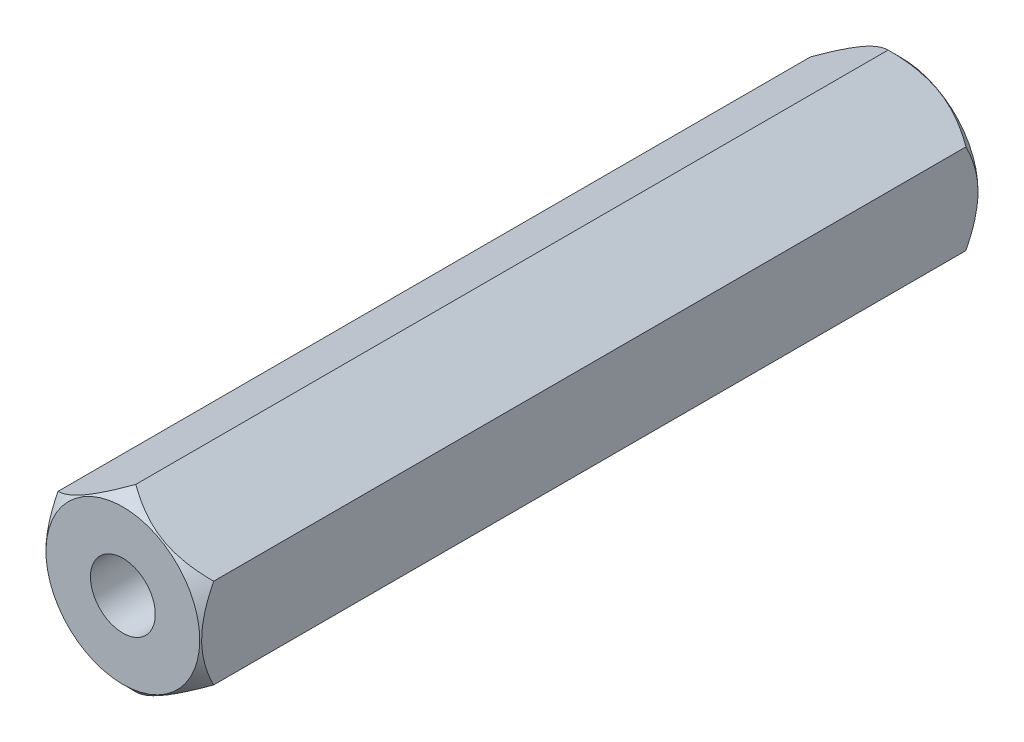
ISO-10303-21;
HEADER;
FILE_DESCRIPTION(('STEP AP214'),'2;1');
FILE_NAME('part.step','',(''),(''),'','','');
FILE_SCHEMA(('AUTOMOTIVE_DESIGN { 1 0 10303 214 1 1 1 1 }'));
ENDSEC;
DATA;
#1=APPLICATION_CONTEXT('core data for automotive mechanical design processes');
#2=APPLICATION_PROTOCOL_DEFINITION('international standard','automotive_design',2000,#1);
#3=PRODUCT_CONTEXT('',#1,'mechanical');
#4=PRODUCT('Part','Part','',(#3));
#5=PRODUCT_RELATED_PRODUCT_CATEGORY('part','',(#4));
#6=PRODUCT_DEFINITION_FORMATION('','',#4);
#7=PRODUCT_DEFINITION_CONTEXT('part definition',#1,'design');
#8=PRODUCT_DEFINITION('design','',#6,#7);
#9=PRODUCT_DEFINITION_SHAPE('','',#8);
#10=(LENGTH_UNIT() NAMED_UNIT(*) SI_UNIT(.MILLI.,.METRE.));
#11=(NAMED_UNIT(*) PLANE_ANGLE_UNIT() SI_UNIT($,.RADIAN.));
#12=(NAMED_UNIT(*) SI_UNIT($,.STERADIAN.) SOLID_ANGLE_UNIT());
#13=UNCERTAINTY_MEASURE_WITH_UNIT(LENGTH_MEASURE(1.E-05),#10,'distance_accuracy_value','');
#14=(GEOMETRIC_REPRESENTATION_CONTEXT(3) GLOBAL_UNCERTAINTY_ASSIGNED_CONTEXT((#13)) GLOBAL_UNIT_ASSIGNED_CONTEXT((#10,
#11,#12)) REPRESENTATION_CONTEXT('',''));
#15=CARTESIAN_POINT('',(0.,0.,0.));
#16=DIRECTION('',(0.,0.,1.));
#17=DIRECTION('',(1.,0.,0.));
#18=AXIS2_PLACEMENT_3D('',#15,#16,#17);
#19=CARTESIAN_POINT('',(0.,0.,30.));
#20=DIRECTION('',(0.,0.,1.));
#21=DIRECTION('',(1.,0.,0.));
#22=AXIS2_PLACEMENT_3D('',#19,#20,#21);
#23=PLANE('',#22);
#24=CARTESIAN_POINT('',(0.,0.,30.));
#25=DIRECTION('',(0.,0.,1.));
#26=DIRECTION('',(1.,0.,0.));
#27=AXIS2_PLACEMENT_3D('',#24,#25,#26);
#28=CIRCLE('',#27,2.96410161513776);
#29=CARTESIAN_POINT('',(2.96410161513776,0.,30.));
#30=VERTEX_POINT('',#29);
#31=EDGE_CURVE('E101',#30,#30,#28,.T.);
#32=ORIENTED_EDGE('',*,*,#31,.T.);
#33=EDGE_LOOP('',(#32));
#34=FACE_BOUND('',#33,.T.);
#35=CARTESIAN_POINT('',(0.,0.,30.));
#36=DIRECTION('',(0.,0.,-1.));
#37=DIRECTION('',(-1.,0.,0.));
#38=AXIS2_PLACEMENT_3D('',#35,#36,#37);
#39=CIRCLE('',#38,1.25);
#40=CARTESIAN_POINT('',(-1.25,0.,30.));
#41=VERTEX_POINT('',#40);
#42=EDGE_CURVE('E212',#41,#41,#39,.T.);
#43=ORIENTED_EDGE('',*,*,#42,.T.);
#44=EDGE_LOOP('',(#43));
#45=FACE_BOUND('',#44,.T.);
#46=ADVANCED_FACE('F35',(#34,#45),#23,.T.);
#47=CARTESIAN_POINT('',(0.,0.,0.));
#48=DIRECTION('',(0.,0.,1.));
#49=DIRECTION('',(1.,0.,0.));
#50=AXIS2_PLACEMENT_3D('',#47,#48,#49);
#51=PLANE('',#50);
#52=CARTESIAN_POINT('',(0.,0.,0.));
#53=DIRECTION('',(0.,0.,1.));
#54=DIRECTION('',(1.,0.,0.));
#55=AXIS2_PLACEMENT_3D('',#52,#53,#54);
#56=CIRCLE('',#55,2.96410161513776);
#57=CARTESIAN_POINT('',(2.96410161513776,0.,0.));
#58=VERTEX_POINT('',#57);
#59=EDGE_CURVE('E210',#58,#58,#56,.T.);
#60=ORIENTED_EDGE('',*,*,#59,.F.);
#61=EDGE_LOOP('',(#60));
#62=FACE_BOUND('',#61,.T.);
#63=CARTESIAN_POINT('',(0.,0.,0.));
#64=DIRECTION('',(0.,0.,-1.));
#65=DIRECTION('',(-1.,0.,0.));
#66=AXIS2_PLACEMENT_3D('',#63,#64,#65);
#67=CIRCLE('',#66,1.24999999999999);
#68=CARTESIAN_POINT('',(-1.24999999999999,0.,0.));
#69=VERTEX_POINT('',#68);
#70=EDGE_CURVE('E232',#69,#69,#67,.T.);
#71=ORIENTED_EDGE('',*,*,#70,.F.);
#72=EDGE_LOOP('',(#71));
#73=FACE_BOUND('',#72,.T.);
#74=ADVANCED_FACE('F220',(#62,#73),#51,.F.);
#75=CARTESIAN_POINT('',(2.99999999999996,1.73205080756891,30.));
#76=DIRECTION('',(-0.499999999999998,-0.866025403784439,0.));
#77=DIRECTION('',(0.86602540378444,-0.499999999999999,0.));
#78=AXIS2_PLACEMENT_3D('',#75,#76,#77);
#79=PLANE('',#78);
#80=CARTESIAN_POINT('',(-0.000200000000005701,3.4642170851916,0.500115475827093));
#81=CARTESIAN_POINT('',(0.102923514955752,3.40467869607211,0.440628318321731));
#82=CARTESIAN_POINT('',(0.207771389330664,3.34414474757779,0.384634979465466));
#83=CARTESIAN_POINT('',(0.42156767178113,3.22070940635328,0.282112596378893));
#84=CARTESIAN_POINT('',(0.530536411379804,3.15779627521273,0.235640593741245));
#85=CARTESIAN_POINT('',(0.750266639597091,3.03093496880238,0.156033188516258));
#86=CARTESIAN_POINT('',(0.860972171762284,2.96701910000603,0.122697700642632));
#87=CARTESIAN_POINT('',(1.08482041056542,2.83778025907541,0.0713375439792789));
#88=CARTESIAN_POINT('',(1.19795627920709,2.77246123486014,0.0532745375355815));
#89=CARTESIAN_POINT('',(1.39294095619282,2.65988677911458,0.0369769084504857));
#90=CARTESIAN_POINT('',(1.47453795400227,2.61277673046423,0.0345643671738004));
#91=CARTESIAN_POINT('',(1.63759922883024,2.51863325954789,0.0386294346571176));
#92=CARTESIAN_POINT('',(1.71906344929915,2.47159986993085,0.0451101600283165));
#93=CARTESIAN_POINT('',(1.88122011233856,2.37797867687415,0.0665917225152473));
#94=CARTESIAN_POINT('',(1.9619115887845,2.33139143122678,0.0816020899673097));
#95=CARTESIAN_POINT('',(2.12190869789156,2.23901705721426,0.119323646066059));
#96=CARTESIAN_POINT('',(2.20121443630953,2.19322986779036,0.142034244322884));
#97=CARTESIAN_POINT('',(2.34200614080297,2.11194373930141,0.188760684853999));
#98=CARTESIAN_POINT('',(2.40380372214622,2.07626488907762,0.211548327680848));
#99=CARTESIAN_POINT('',(2.52628941752036,2.00554773988148,0.260796286057478));
#100=CARTESIAN_POINT('',(2.58697749763572,1.97050946049027,0.287256713666218));
#101=CARTESIAN_POINT('',(2.70705299739094,1.90118383838352,0.343256994391358));
#102=CARTESIAN_POINT('',(2.76644383229597,1.8668945238637,0.372787164478353));
#103=CARTESIAN_POINT('',(2.88412556146727,1.79895094584795,0.434539091575483));
#104=CARTESIAN_POINT('',(2.94241710424772,1.76529630793218,0.466759196659295));
#105=CARTESIAN_POINT('',(3.00019999999996,1.73193533751507,0.500115475827071));
#106=B_SPLINE_CURVE_WITH_KNOTS('',3,(#80,#81,#82,#83,#84,#85,#86,#87,#88,#89,#90,#91,#92,#93,
#94,#95,#96,#97,#98,#99,#100,#101,#102,#103,#104,#105),.UNSPECIFIED.,.F.,.F.,(4,2,2,2,2,2,2,2,2,
2,2,2,4),(0.,0.399603557139335,0.801535286397903,1.19708369162351,1.59163620080184,
1.8739894175586,2.15644160919112,2.43921001247448,2.72195674032165,2.94657516661945,
3.17120044767284,3.39513752837811,3.61893808380731),.UNSPECIFIED.);
#107=CARTESIAN_POINT('',(0.,3.46410161513776,0.499999999999945));
#108=VERTEX_POINT('',#107);
#109=CARTESIAN_POINT('',(2.99999999999996,1.73205080756891,0.5));
#110=VERTEX_POINT('',#109);
#111=EDGE_CURVE('E51',#108,#110,#106,.T.);
#112=ORIENTED_EDGE('',*,*,#111,.F.);
#113=DIRECTION('',(0.,0.,-1.));
#114=VECTOR('',#113,1.);
#115=CARTESIAN_POINT('',(0.,3.46410161513776,30.));
#116=LINE('',#115,#114);
#117=CARTESIAN_POINT('',(0.,3.46410161513776,29.5));
#118=VERTEX_POINT('',#117);
#119=EDGE_CURVE('E11',#118,#108,#116,.T.);
#120=ORIENTED_EDGE('',*,*,#119,.F.);
#121=CARTESIAN_POINT('',(3.00019999999996,1.73193533751507,29.4998845241728));
#122=CARTESIAN_POINT('',(2.89707648504422,1.79147372663454,29.5593716816782));
#123=CARTESIAN_POINT('',(2.79222861066933,1.85200767512885,29.6153650205345));
#124=CARTESIAN_POINT('',(2.57843232821891,1.97544301635334,29.717887403621));
#125=CARTESIAN_POINT('',(2.46946358862026,2.03835614749387,29.7643594062587));
#126=CARTESIAN_POINT('',(2.24973336040302,2.1652174539042,29.8439668114837));
#127=CARTESIAN_POINT('',(2.13902782823785,2.22913332270054,29.8773022993573));
#128=CARTESIAN_POINT('',(1.91517958943476,2.35837216363113,29.9286624560207));
#129=CARTESIAN_POINT('',(1.8020437207931,2.42369118784639,29.9467254624644));
#130=CARTESIAN_POINT('',(1.60705904380741,2.53626564359193,29.9630230915495));
#131=CARTESIAN_POINT('',(1.52546204599799,2.58337569224226,29.9654356328262));
#132=CARTESIAN_POINT('',(1.36240077117006,2.67751916315857,29.9613705653429));
#133=CARTESIAN_POINT('',(1.28093655070118,2.7245525527756,29.9548898399717));
#134=CARTESIAN_POINT('',(1.11877988766182,2.81817374583227,29.9334082774848));
#135=CARTESIAN_POINT('',(1.0380884112159,2.86476099147963,29.9183979100328));
#136=CARTESIAN_POINT('',(0.878091302108885,2.95713536549212,29.8806763539341));
#137=CARTESIAN_POINT('',(0.798785563690934,3.00292255491601,29.8579657556772));
#138=CARTESIAN_POINT('',(0.657993859197466,3.08420868340498,29.8112393151461));
#139=CARTESIAN_POINT('',(0.596196277854172,3.1198875336288,29.7884516723193));
#140=CARTESIAN_POINT('',(0.473710582479935,3.19060468282499,29.7392037139426));
#141=CARTESIAN_POINT('',(0.41302250236453,3.22564296221622,29.7127432863339));
#142=CARTESIAN_POINT('',(0.292947002609228,3.29496858432302,29.6567430056087));
#143=CARTESIAN_POINT('',(0.233556167704153,3.32925789884286,29.6272128355217));
#144=CARTESIAN_POINT('',(0.115874438532763,3.39720147685867,29.5654609084245));
#145=CARTESIAN_POINT('',(0.0575828957522782,3.43085611477446,29.5332408033406));
#146=CARTESIAN_POINT('',(-0.000200000000005748,3.4642170851916,29.4998845241728));
#147=B_SPLINE_CURVE_WITH_KNOTS('',3,(#121,#122,#123,#124,#125,#126,#127,#128,#129,#130,#131,
#132,#133,#134,#135,#136,#137,#138,#139,#140,#141,#142,#143,#144,#145,#146),.UNSPECIFIED.,.F.,
.F.,(4,2,2,2,2,2,2,2,2,2,2,2,4),(0.,0.399603557139266,0.801535286397766,1.19708369162331,
1.59163620080157,1.87398941755825,2.15644160919069,2.43921001247397,2.72195674032106,
2.94657516661902,3.17120044767258,3.39513752837801,3.61893808380738),.UNSPECIFIED.);
#148=CARTESIAN_POINT('',(2.99999999999996,1.73205080756895,29.5));
#149=VERTEX_POINT('',#148);
#150=EDGE_CURVE('E107',#149,#118,#147,.T.);
#151=ORIENTED_EDGE('',*,*,#150,.F.);
#152=DIRECTION('',(0.,0.,-1.));
#153=VECTOR('',#152,1.);
#154=CARTESIAN_POINT('',(2.99999999999996,1.73205080756891,30.));
#155=LINE('',#154,#153);
#156=EDGE_CURVE('E100',#149,#110,#155,.T.);
#157=ORIENTED_EDGE('',*,*,#156,.T.);
#158=EDGE_LOOP('',(#112,#120,#151,#157));
#159=FACE_BOUND('',#158,.T.);
#160=ADVANCED_FACE('F37',(#159),#79,.F.);
#161=CARTESIAN_POINT('',(0.,3.46410161513776,30.));
#162=DIRECTION('',(0.500000000000001,-0.866025403784438,0.));
#163=DIRECTION('',(0.866025403784438,0.500000000000001,0.));
#164=AXIS2_PLACEMENT_3D('',#161,#162,#163);
#165=PLANE('',#164);
#166=CARTESIAN_POINT('',(-3.00019999999998,1.73193533751505,0.500115475827081));
#167=CARTESIAN_POINT('',(-2.89707648504423,1.79147372663454,0.44062831832172));
#168=CARTESIAN_POINT('',(-2.79222861066932,1.85200767512885,0.384634979465456));
#169=CARTESIAN_POINT('',(-2.57843232821885,1.97544301635337,0.282112596378885));
#170=CARTESIAN_POINT('',(-2.46946358862018,2.03835614749392,0.235640593741239));
#171=CARTESIAN_POINT('',(-2.2497333604029,2.16521745390426,0.156033188516255));
#172=CARTESIAN_POINT('',(-2.13902782823771,2.22913332270062,0.122697700642629));
#173=CARTESIAN_POINT('',(-1.91517958943458,2.35837216363123,0.0713375439792778));
#174=CARTESIAN_POINT('',(-1.8020437207929,2.4236911878465,0.053274537535581));
#175=CARTESIAN_POINT('',(-1.60705904380717,2.53626564359206,0.0369769084504857));
#176=CARTESIAN_POINT('',(-1.52546204599773,2.58337569224241,0.0345643671738006));
#177=CARTESIAN_POINT('',(-1.36240077116975,2.67751916315875,0.0386294346571182));
#178=CARTESIAN_POINT('',(-1.28093655070084,2.7245525527758,0.0451101600283174));
#179=CARTESIAN_POINT('',(-1.11877988766144,2.81817374583249,0.0665917225152486));
#180=CARTESIAN_POINT('',(-1.0380884112155,2.86476099147986,0.081602089967311));
#181=CARTESIAN_POINT('',(-0.878091302108441,2.95713536549238,0.119323646066061));
#182=CARTESIAN_POINT('',(-0.79878556369047,3.00292255491628,0.142034244322887));
#183=CARTESIAN_POINT('',(-0.657993859197026,3.08420868340524,0.188760684854003));
#184=CARTESIAN_POINT('',(-0.596196277853775,3.11988753362903,0.211548327680853));
#185=CARTESIAN_POINT('',(-0.473710582479625,3.19060468282517,0.260796286057485));
#186=CARTESIAN_POINT('',(-0.413022502364262,3.22564296221638,0.287256713666226));
#187=CARTESIAN_POINT('',(-0.292947002609044,3.29496858432313,0.34325699439137));
#188=CARTESIAN_POINT('',(-0.23355616770401,3.32925789884295,0.372787164478367));
#189=CARTESIAN_POINT('',(-0.115874438532699,3.39720147685871,0.434539091575501));
#190=CARTESIAN_POINT('',(-0.0575828957522526,3.43085611477448,0.466759196659314));
#191=CARTESIAN_POINT('',(0.000199999999994195,3.4642170851916,0.500115475827093));
#192=B_SPLINE_CURVE_WITH_KNOTS('',3,(#166,#167,#168,#169,#170,#171,#172,#173,#174,#175,#176,
#177,#178,#179,#180,#181,#182,#183,#184,#185,#186,#187,#188,#189,#190,#191),.UNSPECIFIED.,.F.,
.F.,(4,2,2,2,2,2,2,2,2,2,2,2,4),(0.,0.399603557139329,0.801535286397891,1.1970836916235,
1.59163620080182,1.87398941755857,2.1564416091911,2.43921001247446,2.72195674032163,
2.94657516661944,3.17120044767284,3.39513752837812,3.61893808380733),.UNSPECIFIED.);
#193=CARTESIAN_POINT('',(-2.99999999999998,1.73205080756891,0.499999999999945));
#194=VERTEX_POINT('',#193);
#195=EDGE_CURVE('E87',#194,#108,#192,.T.);
#196=ORIENTED_EDGE('',*,*,#195,.F.);
#197=DIRECTION('',(0.,0.,-1.));
#198=VECTOR('',#197,1.);
#199=CARTESIAN_POINT('',(-2.99999999999998,1.73205080756889,30.));
#200=LINE('',#199,#198);
#201=CARTESIAN_POINT('',(-2.99999999999998,1.73205080756891,29.5));
#202=VERTEX_POINT('',#201);
#203=EDGE_CURVE('E44',#202,#194,#200,.T.);
#204=ORIENTED_EDGE('',*,*,#203,.F.);
#205=CARTESIAN_POINT('',(0.000199999999993908,3.4642170851916,29.4998845241728));
#206=CARTESIAN_POINT('',(-0.102923514955743,3.40467869607212,29.5593716816782));
#207=CARTESIAN_POINT('',(-0.207771389330635,3.34414474757782,29.6153650205345));
#208=CARTESIAN_POINT('',(-0.42156767178106,3.22070940635332,29.717887403621));
#209=CARTESIAN_POINT('',(-0.530536411379713,3.15779627521278,29.7643594062587));
#210=CARTESIAN_POINT('',(-0.750266639596961,3.03093496880246,29.8439668114837));
#211=CARTESIAN_POINT('',(-0.860972171762134,2.96701910000611,29.8773022993573));
#212=CARTESIAN_POINT('',(-1.08482041056523,2.83778025907552,29.9286624560207));
#213=CARTESIAN_POINT('',(-1.19795627920689,2.77246123486026,29.9467254624644));
#214=CARTESIAN_POINT('',(-1.39294095619258,2.65988677911472,29.9630230915495));
#215=CARTESIAN_POINT('',(-1.47453795400199,2.61277673046439,29.9654356328262));
#216=CARTESIAN_POINT('',(-1.63759922882993,2.51863325954808,29.9613705653429));
#217=CARTESIAN_POINT('',(-1.71906344929881,2.47159986993104,29.9548898399717));
#218=CARTESIAN_POINT('',(-1.88122011233817,2.37797867687438,29.9334082774848));
#219=CARTESIAN_POINT('',(-1.96191158878409,2.33139143122702,29.9183979100328));
#220=CARTESIAN_POINT('',(-2.1219086978911,2.23901705721452,29.8806763539341));
#221=CARTESIAN_POINT('',(-2.20121443630905,2.19322986779064,29.8579657556773));
#222=CARTESIAN_POINT('',(-2.34200614080252,2.11194373930166,29.8112393151461));
#223=CARTESIAN_POINT('',(-2.40380372214581,2.07626488907785,29.7884516723193));
#224=CARTESIAN_POINT('',(-2.52628941752005,2.00554773988165,29.7392037139426));
#225=CARTESIAN_POINT('',(-2.58697749763545,1.97050946049042,29.7127432863339));
#226=CARTESIAN_POINT('',(-2.70705299739075,1.90118383838362,29.6567430056087));
#227=CARTESIAN_POINT('',(-2.76644383229582,1.86689452386378,29.6272128355217));
#228=CARTESIAN_POINT('',(-2.88412556146721,1.79895094584798,29.5654609084245));
#229=CARTESIAN_POINT('',(-2.9424171042477,1.76529630793219,29.5332408033406));
#230=CARTESIAN_POINT('',(-3.00019999999998,1.73193533751505,29.4998845241728));
#231=B_SPLINE_CURVE_WITH_KNOTS('',3,(#205,#206,#207,#208,#209,#210,#211,#212,#213,#214,#215,
#216,#217,#218,#219,#220,#221,#222,#223,#224,#225,#226,#227,#228,#229,#230),.UNSPECIFIED.,.F.,
.F.,(4,2,2,2,2,2,2,2,2,2,2,2,4),(0.,0.399603557139274,0.801535286397781,1.19708369162334,
1.59163620080161,1.87398941755828,2.15644160919072,2.439210012474,2.72195674032109,
2.94657516661905,3.1712004476726,3.39513752837803,3.61893808380739),.UNSPECIFIED.);
#232=EDGE_CURVE('E105',#118,#202,#231,.T.);
#233=ORIENTED_EDGE('',*,*,#232,.F.);
#234=ORIENTED_EDGE('',*,*,#119,.T.);
#235=EDGE_LOOP('',(#196,#204,#233,#234));
#236=FACE_BOUND('',#235,.T.);
#237=ADVANCED_FACE('F104',(#236),#165,.F.);
#238=CARTESIAN_POINT('',(-2.99999999999998,1.73205080756889,30.));
#239=DIRECTION('',(1.,0.,0.));
#240=DIRECTION('',(0.,0.,-1.));
#241=AXIS2_PLACEMENT_3D('',#238,#239,#240);
#242=PLANE('',#241);
#243=CARTESIAN_POINT('',(-2.99999999999998,-3.60017220967197,1.72218048683737));
#244=CARTESIAN_POINT('',(-2.99999999999998,-3.51313765104608,1.65533240857107));
#245=CARTESIAN_POINT('',(-2.99999999999998,-3.42563249287256,1.5890873806316));
#246=CARTESIAN_POINT('',(-2.99999999999998,-3.24948921836687,1.45807845308333));
#247=CARTESIAN_POINT('',(-2.99999999999998,-3.16085083752033,1.39331490949562));
#248=CARTESIAN_POINT('',(-2.99999999999998,-2.98160145725491,1.26508305506886));
#249=CARTESIAN_POINT('',(-2.99999999999998,-2.89098051262283,1.20162860058426));
#250=CARTESIAN_POINT('',(-2.99999999999998,-2.70822761313709,1.07694169073735));
#251=CARTESIAN_POINT('',(-2.99999999999998,-2.6160957631826,1.01570908205705));
#252=CARTESIAN_POINT('',(-2.99999999999998,-2.42422306954662,0.892208762314601));
#253=CARTESIAN_POINT('',(-2.99999999999998,-2.32436788808338,0.830117796525084));
#254=CARTESIAN_POINT('',(-2.99999999999998,-2.12231355534733,0.709809653506304));
#255=CARTESIAN_POINT('',(-2.99999999999998,-2.02011401548867,0.651593124809616));
#256=CARTESIAN_POINT('',(-2.99999999999998,-1.81334633897003,0.540275149217509));
#257=CARTESIAN_POINT('',(-2.99999999999998,-1.70878635206413,0.487158682951906));
#258=CARTESIAN_POINT('',(-2.99999999999998,-1.49671956345562,0.387230840223835));
#259=CARTESIAN_POINT('',(-2.99999999999998,-1.38921417585871,0.340416499767422));
#260=CARTESIAN_POINT('',(-2.99999999999998,-1.18162451020426,0.258946051762336));
#261=CARTESIAN_POINT('',(-2.99999999999998,-1.0818333202557,0.223550747964497));
#262=CARTESIAN_POINT('',(-2.99999999999998,-0.87972092224441,0.160749094146928));
#263=CARTESIAN_POINT('',(-2.99999999999998,-0.777399552418906,0.133343256360222));
#264=CARTESIAN_POINT('',(-2.99999999999998,-0.572612584452552,0.0884558409846685));
#265=CARTESIAN_POINT('',(-2.99999999999998,-0.470186961346654,0.0707949437776185));
#266=CARTESIAN_POINT('',(-2.99999999999998,-0.264078945488416,0.0457637249666117));
#267=CARTESIAN_POINT('',(-2.99999999999998,-0.160396813561062,0.0383913033834457));
#268=CARTESIAN_POINT('',(-2.99999999999998,0.0427096176215057,0.0345579148449175));
#269=CARTESIAN_POINT('',(-2.99999999999998,0.142125414358382,0.037641649482053));
#270=CARTESIAN_POINT('',(-2.99999999999998,0.340174705597096,0.0535083583046858));
#271=CARTESIAN_POINT('',(-2.99999999999998,0.438808127729325,0.0662922194192052));
#272=CARTESIAN_POINT('',(-2.99999999999998,0.636249949703818,0.101055919672368));
#273=CARTESIAN_POINT('',(-2.99999999999998,0.735029372916008,0.123197581102988));
#274=CARTESIAN_POINT('',(-2.99999999999998,0.930415217780308,0.175452782519873));
#275=CARTESIAN_POINT('',(-2.99999999999998,1.02702176788822,0.205565849901872));
#276=CARTESIAN_POINT('',(-2.99999999999998,1.2236758633486,0.274476354799725));
#277=CARTESIAN_POINT('',(-2.99999999999998,1.32357580295885,0.313690302495117));
#278=CARTESIAN_POINT('',(-2.99999999999998,1.520791158334,0.398168470472808));
#279=CARTESIAN_POINT('',(-2.99999999999998,1.61810572975048,0.443434638911345));
#280=CARTESIAN_POINT('',(-2.99999999999998,1.81063206524874,0.53895130914026));
#281=CARTESIAN_POINT('',(-2.99999999999998,1.90583595858597,0.58921754686616));
#282=CARTESIAN_POINT('',(-2.99999999999998,2.0940594283909,0.693623745361634));
#283=CARTESIAN_POINT('',(-2.99999999999998,2.18707938593184,0.74776302355425));
#284=CARTESIAN_POINT('',(-2.99999999999998,2.36667514656249,0.856408339135955));
#285=CARTESIAN_POINT('',(-2.99999999999998,2.4533423013475,0.910764165621203));
#286=CARTESIAN_POINT('',(-2.99999999999998,2.62518767354664,1.0217874473238));
#287=CARTESIAN_POINT('',(-2.99999999999998,2.71036577854129,1.07845507600888));
#288=CARTESIAN_POINT('',(-2.99999999999998,2.87874255832996,1.19322778247567));
#289=CARTESIAN_POINT('',(-2.99999999999998,2.96195163950994,1.25131764848717));
#290=CARTESIAN_POINT('',(-2.99999999999998,3.12722859541867,1.36905303202698));
#291=CARTESIAN_POINT('',(-2.99999999999998,3.20929677837782,1.4286981163561));
#292=CARTESIAN_POINT('',(-2.99999999999998,3.29088643476973,1.48897973675217));
#293=B_SPLINE_CURVE_WITH_KNOTS('',3,(#243,#244,#245,#246,#247,#248,#249,#250,#251,#252,#253,
#254,#255,#256,#257,#258,#259,#260,#261,#262,#263,#264,#265,#266,#267,#268,#269,#270,#271,#272,
#273,#274,#275,#276,#277,#278,#279,#280,#281,#282,#283,#284,#285,#286,#287,#288,#289,#290,#291,
#292),.UNSPECIFIED.,.F.,.F.,(4,2,2,2,2,2,2,2,2,2,2,2,2,2,2,2,2,2,2,2,2,2,2,2,4),(0.,
0.329237185389713,0.658552677025029,0.990410104597558,1.32224458870019,1.67493114147268,
2.02767658187222,2.37934911783593,2.73085567419858,3.04822903781351,3.36562274488843,
3.67696266306287,3.9882390243945,4.28613845351088,4.58406512428162,4.88736936813588,
5.19065563388327,5.51237069563673,5.83418956505982,6.15705537344444,6.47986442011691,
6.78672818696454,7.09361502205778,7.39803558554833,7.70237224126045),.UNSPECIFIED.);
#294=CARTESIAN_POINT('',(-3.00000000000002,-1.73205080756885,0.499999999999945));
#295=VERTEX_POINT('',#294);
#296=EDGE_CURVE('E90',#295,#194,#293,.T.);
#297=ORIENTED_EDGE('',*,*,#296,.F.);
#298=DIRECTION('',(0.,0.,-1.));
#299=VECTOR('',#298,1.);
#300=CARTESIAN_POINT('',(-2.99999999999998,-1.73205080756887,30.));
#301=LINE('',#300,#299);
#302=CARTESIAN_POINT('',(-3.00000000000002,-1.73205080756885,29.5));
#303=VERTEX_POINT('',#302);
#304=EDGE_CURVE('E201',#303,#295,#301,.T.);
#305=ORIENTED_EDGE('',*,*,#304,.F.);
#306=CARTESIAN_POINT('',(-2.99999999999998,-3.60017220967165,28.2778195131625));
#307=CARTESIAN_POINT('',(-2.99999999999998,-3.51313765104578,28.3446675914288));
#308=CARTESIAN_POINT('',(-2.99999999999998,-3.42563249287227,28.4109126193683));
#309=CARTESIAN_POINT('',(-2.99999999999998,-3.2494892183666,28.5419215469166));
#310=CARTESIAN_POINT('',(-2.99999999999998,-3.16085083752008,28.6066850905043));
#311=CARTESIAN_POINT('',(-2.99999999999998,-2.98160145725469,28.734916944931));
#312=CARTESIAN_POINT('',(-2.99999999999998,-2.89098051262261,28.7983713994157));
#313=CARTESIAN_POINT('',(-2.99999999999998,-2.7082276131369,28.9230583092626));
#314=CARTESIAN_POINT('',(-2.99999999999998,-2.61609576318242,28.9842909179429));
#315=CARTESIAN_POINT('',(-2.99999999999998,-2.42422306954647,29.1077912376853));
#316=CARTESIAN_POINT('',(-2.99999999999998,-2.32436788808324,29.1698822034748));
#317=CARTESIAN_POINT('',(-2.99999999999998,-2.12231355534722,29.2901903464936));
#318=CARTESIAN_POINT('',(-2.99999999999998,-2.02011401548857,29.3484068751903));
#319=CARTESIAN_POINT('',(-2.99999999999998,-1.81334633896995,29.4597248507824));
#320=CARTESIAN_POINT('',(-2.99999999999998,-1.70878635206407,29.512841317048));
#321=CARTESIAN_POINT('',(-2.99999999999998,-1.49671956345558,29.6127691597761));
#322=CARTESIAN_POINT('',(-2.99999999999998,-1.38921417585868,29.6595835002325));
#323=CARTESIAN_POINT('',(-2.99999999999998,-1.18162451020427,29.7410539482376));
#324=CARTESIAN_POINT('',(-2.99999999999998,-1.08183332025573,29.7764492520355));
#325=CARTESIAN_POINT('',(-2.99999999999998,-0.879720922244481,29.839250905853));
#326=CARTESIAN_POINT('',(-2.99999999999998,-0.777399552419,29.8666567436398));
#327=CARTESIAN_POINT('',(-2.99999999999998,-0.572612584452689,29.9115441590153));
#328=CARTESIAN_POINT('',(-2.99999999999998,-0.470186961346812,29.9292050562224));
#329=CARTESIAN_POINT('',(-2.99999999999998,-0.264078945488616,29.9542362750334));
#330=CARTESIAN_POINT('',(-2.99999999999998,-0.160396813561283,29.9616086966166));
#331=CARTESIAN_POINT('',(-2.99999999999998,0.0427096176212497,29.9654420851551));
#332=CARTESIAN_POINT('',(-2.99999999999998,0.142125414358112,29.962358350518));
#333=CARTESIAN_POINT('',(-2.99999999999998,0.340174705596797,29.9464916416954));
#334=CARTESIAN_POINT('',(-2.99999999999998,0.438808127729012,29.9337077805809));
#335=CARTESIAN_POINT('',(-2.99999999999998,0.636249949703477,29.8989440803277));
#336=CARTESIAN_POINT('',(-2.99999999999998,0.735029372915653,29.8768024188971));
#337=CARTESIAN_POINT('',(-2.99999999999998,0.930415217779925,29.8245472174802));
#338=CARTESIAN_POINT('',(-2.99999999999998,1.02702176788783,29.7944341500982));
#339=CARTESIAN_POINT('',(-2.99999999999998,1.22367586334813,29.7255236452004));
#340=CARTESIAN_POINT('',(-2.99999999999998,1.32357580295832,29.6863096975051));
#341=CARTESIAN_POINT('',(-2.99999999999998,1.52079115833336,29.6018315295274));
#342=CARTESIAN_POINT('',(-2.99999999999998,1.61810572974978,29.5565653610889));
#343=CARTESIAN_POINT('',(-2.99999999999998,1.81063206524793,29.4610486908601));
#344=CARTESIAN_POINT('',(-2.99999999999998,1.9058359585851,29.4107824531342));
#345=CARTESIAN_POINT('',(-2.99999999999998,2.09405942838992,29.3063762546388));
#346=CARTESIAN_POINT('',(-2.99999999999998,2.18707938593081,29.2522369764462));
#347=CARTESIAN_POINT('',(-2.99999999999998,2.36667514656135,29.1435916608646));
#348=CARTESIAN_POINT('',(-2.99999999999998,2.45334230134632,29.0892358343794));
#349=CARTESIAN_POINT('',(-2.99999999999998,2.62518767354536,28.9782125526768));
#350=CARTESIAN_POINT('',(-2.99999999999998,2.71036577853997,28.9215449239918));
#351=CARTESIAN_POINT('',(-2.99999999999998,2.87874255832854,28.8067722175251));
#352=CARTESIAN_POINT('',(-2.99999999999998,2.96195163950848,28.7486823515136));
#353=CARTESIAN_POINT('',(-2.99999999999998,3.12722859541711,28.6309469679739));
#354=CARTESIAN_POINT('',(-2.99999999999998,3.20929677837621,28.5713018836448));
#355=CARTESIAN_POINT('',(-2.99999999999998,3.29088643476808,28.5110202632487));
#356=B_SPLINE_CURVE_WITH_KNOTS('',3,(#306,#307,#308,#309,#310,#311,#312,#313,#314,#315,#316,
#317,#318,#319,#320,#321,#322,#323,#324,#325,#326,#327,#328,#329,#330,#331,#332,#333,#334,#335,
#336,#337,#338,#339,#340,#341,#342,#343,#344,#345,#346,#347,#348,#349,#350,#351,#352,#353,#354,
#355),.UNSPECIFIED.,.F.,.F.,(4,2,2,2,2,2,2,2,2,2,2,2,2,2,2,2,2,2,2,2,2,2,2,2,4),(0.,
0.329237185389686,0.658552677024972,0.990410104597472,1.32224458870008,1.67493114147254,
2.02767658187205,2.37934911783574,2.73085567419837,3.04822903781323,3.36562274488809,
3.67696266306247,3.98823902439404,4.28613845351038,4.58406512428107,4.88736936813528,
5.19065563388263,5.51237069563589,5.83418956505879,6.15705537344321,6.47986442011548,
6.78672818696294,7.093615022056,7.39803558554638,7.70237224125833),.UNSPECIFIED.);
#357=EDGE_CURVE('E108',#202,#303,#356,.F.);
#358=ORIENTED_EDGE('',*,*,#357,.F.);
#359=ORIENTED_EDGE('',*,*,#203,.T.);
#360=EDGE_LOOP('',(#297,#305,#358,#359));
#361=FACE_BOUND('',#360,.T.);
#362=ADVANCED_FACE('F162',(#361),#242,.F.);
#363=CARTESIAN_POINT('',(-2.99999999999998,-1.73205080756887,30.));
#364=DIRECTION('',(0.499999999999999,0.866025403784439,0.));
#365=DIRECTION('',(-0.866025403784439,0.499999999999999,0.));
#366=AXIS2_PLACEMENT_3D('',#363,#364,#365);
#367=PLANE('',#366);
#368=CARTESIAN_POINT('',(0.000200000000013938,-3.46421708519158,0.500115475827079));
#369=CARTESIAN_POINT('',(-0.102923514955744,-3.40467869607209,0.440628318321718));
#370=CARTESIAN_POINT('',(-0.207771389330656,-3.34414474757778,0.384634979465452));
#371=CARTESIAN_POINT('',(-0.421567671781122,-3.22070940635326,0.282112596378877));
#372=CARTESIAN_POINT('',(-0.530536411379796,-3.15779627521271,0.235640593741229));
#373=CARTESIAN_POINT('',(-0.750266639597084,-3.03093496880236,0.156033188516241));
#374=CARTESIAN_POINT('',(-0.860972171762277,-2.96701910000601,0.122697700642615));
#375=CARTESIAN_POINT('',(-1.08482041056541,-2.8377802590754,0.0713375439792616));
#376=CARTESIAN_POINT('',(-1.19795627920709,-2.77246123486012,0.053274537535564));
#377=CARTESIAN_POINT('',(-1.39294095619281,-2.65988677911456,0.0369769084504681));
#378=CARTESIAN_POINT('',(-1.47453795400226,-2.61277673046421,0.0345643671737829));
#379=CARTESIAN_POINT('',(-1.63759922883024,-2.51863325954788,0.0386294346570998));
#380=CARTESIAN_POINT('',(-1.71906344929915,-2.47159986993083,0.0451101600282983));
#381=CARTESIAN_POINT('',(-1.88122011233855,-2.37797867687414,0.0665917225152288));
#382=CARTESIAN_POINT('',(-1.96191158878449,-2.33139143122676,0.0816020899672912));
#383=CARTESIAN_POINT('',(-2.12190869789154,-2.23901705721425,0.119323646066041));
#384=CARTESIAN_POINT('',(-2.20121443630952,-2.19322986779035,0.142034244322866));
#385=CARTESIAN_POINT('',(-2.34200614080296,-2.11194373930139,0.188760684853981));
#386=CARTESIAN_POINT('',(-2.40380372214621,-2.0762648890776,0.211548327680831));
#387=CARTESIAN_POINT('',(-2.52628941752036,-2.00554773988145,0.260796286057464));
#388=CARTESIAN_POINT('',(-2.58697749763572,-1.97050946049025,0.287256713666205));
#389=CARTESIAN_POINT('',(-2.70705299739094,-1.90118383838349,0.343256994391349));
#390=CARTESIAN_POINT('',(-2.76644383229598,-1.86689452386368,0.372787164478346));
#391=CARTESIAN_POINT('',(-2.88412556146729,-1.79895094584792,0.434539091575479));
#392=CARTESIAN_POINT('',(-2.94241710424774,-1.76529630793215,0.466759196659293));
#393=CARTESIAN_POINT('',(-3.00019999999998,-1.73193533751503,0.500115475827072));
#394=B_SPLINE_CURVE_WITH_KNOTS('',3,(#368,#369,#370,#371,#372,#373,#374,#375,#376,#377,#378,
#379,#380,#381,#382,#383,#384,#385,#386,#387,#388,#389,#390,#391,#392,#393),.UNSPECIFIED.,.F.,
.F.,(4,2,2,2,2,2,2,2,2,2,2,2,4),(0.,0.399603557139336,0.801535286397905,1.19708369162352,
1.59163620080185,1.8739894175586,2.15644160919112,2.43921001247448,2.72195674032165,
2.94657516661946,3.17120044767286,3.39513752837814,3.61893808380735),.UNSPECIFIED.);
#395=CARTESIAN_POINT('',(0.,-3.46410161513776,0.499999999999945));
#396=VERTEX_POINT('',#395);
#397=EDGE_CURVE('E168',#396,#295,#394,.T.);
#398=ORIENTED_EDGE('',*,*,#397,.F.);
#399=DIRECTION('',(0.,0.,-1.));
#400=VECTOR('',#399,1.);
#401=CARTESIAN_POINT('',(0.,-3.46410161513774,30.));
#402=LINE('',#401,#400);
#403=CARTESIAN_POINT('',(0.,-3.46410161513776,29.5));
#404=VERTEX_POINT('',#403);
#405=EDGE_CURVE('E196',#404,#396,#402,.T.);
#406=ORIENTED_EDGE('',*,*,#405,.F.);
#407=CARTESIAN_POINT('',(-3.00019999999998,-1.73193533751503,29.4998845241728));
#408=CARTESIAN_POINT('',(-2.89707648504424,-1.79147372663451,29.5593716816782));
#409=CARTESIAN_POINT('',(-2.79222861066935,-1.85200767512881,29.6153650205345));
#410=CARTESIAN_POINT('',(-2.57843232821893,-1.97544301635331,29.7178874036211));
#411=CARTESIAN_POINT('',(-2.46946358862028,-2.03835614749384,29.7643594062587));
#412=CARTESIAN_POINT('',(-2.24973336040303,-2.16521745390417,29.8439668114837));
#413=CARTESIAN_POINT('',(-2.13902782823785,-2.22913332270051,29.8773022993573));
#414=CARTESIAN_POINT('',(-1.91517958943476,-2.3583721636311,29.9286624560207));
#415=CARTESIAN_POINT('',(-1.8020437207931,-2.42369118784636,29.9467254624644));
#416=CARTESIAN_POINT('',(-1.60705904380742,-2.5362656435919,29.9630230915495));
#417=CARTESIAN_POINT('',(-1.525462045998,-2.58337569224224,29.9654356328262));
#418=CARTESIAN_POINT('',(-1.36240077117007,-2.67751916315855,29.9613705653429));
#419=CARTESIAN_POINT('',(-1.28093655070118,-2.72455255277558,29.9548898399717));
#420=CARTESIAN_POINT('',(-1.11877988766182,-2.81817374583224,29.9334082774848));
#421=CARTESIAN_POINT('',(-1.0380884112159,-2.8647609914796,29.9183979100328));
#422=CARTESIAN_POINT('',(-0.878091302108892,-2.9571353654921,29.8806763539341));
#423=CARTESIAN_POINT('',(-0.798785563690942,-3.00292255491598,29.8579657556773));
#424=CARTESIAN_POINT('',(-0.657993859197471,-3.08420868340496,29.8112393151462));
#425=CARTESIAN_POINT('',(-0.596196277854175,-3.11988753362878,29.7884516723193));
#426=CARTESIAN_POINT('',(-0.473710582479936,-3.19060468282497,29.7392037139426));
#427=CARTESIAN_POINT('',(-0.41302250236453,-3.2256429622162,29.7127432863339));
#428=CARTESIAN_POINT('',(-0.292947002609227,-3.294968584323,29.6567430056087));
#429=CARTESIAN_POINT('',(-0.233556167704151,-3.32925789884285,29.6272128355217));
#430=CARTESIAN_POINT('',(-0.115874438532759,-3.39720147685865,29.5654609084245));
#431=CARTESIAN_POINT('',(-0.0575828957522727,-3.43085611477444,29.5332408033406));
#432=CARTESIAN_POINT('',(0.000200000000012753,-3.46421708519158,29.4998845241728));
#433=B_SPLINE_CURVE_WITH_KNOTS('',3,(#407,#408,#409,#410,#411,#412,#413,#414,#415,#416,#417,
#418,#419,#420,#421,#422,#423,#424,#425,#426,#427,#428,#429,#430,#431,#432),.UNSPECIFIED.,.F.,
.F.,(4,2,2,2,2,2,2,2,2,2,2,2,4),(0.,0.399603557139273,0.80153528639778,1.19708369162333,
1.5916362008016,1.87398941755827,2.15644160919071,2.43921001247399,2.72195674032108,
2.94657516661905,3.1712004476726,3.39513752837804,3.61893808380742),.UNSPECIFIED.);
#434=EDGE_CURVE('E111',#303,#404,#433,.T.);
#435=ORIENTED_EDGE('',*,*,#434,.F.);
#436=ORIENTED_EDGE('',*,*,#304,.T.);
#437=EDGE_LOOP('',(#398,#406,#435,#436));
#438=FACE_BOUND('',#437,.T.);
#439=ADVANCED_FACE('F158',(#438),#367,.F.);
#440=CARTESIAN_POINT('',(0.,-3.46410161513774,30.));
#441=DIRECTION('',(-0.499999999999999,0.866025403784439,0.));
#442=DIRECTION('',(-0.866025403784439,-0.5,0.));
#443=AXIS2_PLACEMENT_3D('',#440,#441,#442);
#444=PLANE('',#443);
#445=CARTESIAN_POINT('',(3.00019999999996,-1.73193533751506,0.500115475827068));
#446=CARTESIAN_POINT('',(2.89707648504421,-1.79147372663455,0.440628318321709));
#447=CARTESIAN_POINT('',(2.7922286106693,-1.85200767512886,0.384634979465445));
#448=CARTESIAN_POINT('',(2.57843232821884,-1.97544301635338,0.282112596378876));
#449=CARTESIAN_POINT('',(2.46946358862016,-2.03835614749392,0.235640593741231));
#450=CARTESIAN_POINT('',(2.24973336040288,-2.16521745390427,0.156033188516248));
#451=CARTESIAN_POINT('',(2.13902782823769,-2.22913332270062,0.122697700642623));
#452=CARTESIAN_POINT('',(1.91517958943456,-2.35837216363123,0.0713375439792725));
#453=CARTESIAN_POINT('',(1.80204372079289,-2.4236911878465,0.0532745375355763));
#454=CARTESIAN_POINT('',(1.60705904380716,-2.53626564359206,0.0369769084504812));
#455=CARTESIAN_POINT('',(1.52546204599772,-2.58337569224241,0.0345643671737961));
#456=CARTESIAN_POINT('',(1.36240077116974,-2.67751916315875,0.0386294346571138));
#457=CARTESIAN_POINT('',(1.28093655070083,-2.7245525527758,0.0451101600283133));
#458=CARTESIAN_POINT('',(1.11877988766143,-2.81817374583249,0.0665917225152446));
#459=CARTESIAN_POINT('',(1.03808841121549,-2.86476099147986,0.081602089967307));
#460=CARTESIAN_POINT('',(0.878091302108432,-2.95713536549238,0.119323646066057));
#461=CARTESIAN_POINT('',(0.798785563690461,-3.00292255491628,0.142034244322883));
#462=CARTESIAN_POINT('',(0.657993859197018,-3.08420868340523,0.188760684853998));
#463=CARTESIAN_POINT('',(0.596196277853769,-3.11988753362903,0.211548327680848));
#464=CARTESIAN_POINT('',(0.473710582479622,-3.19060468282517,0.260796286057479));
#465=CARTESIAN_POINT('',(0.41302250236426,-3.22564296221637,0.28725671366622));
#466=CARTESIAN_POINT('',(0.292947002609045,-3.29496858432313,0.343256994391361));
#467=CARTESIAN_POINT('',(0.233556167704012,-3.32925789884294,0.372787164478357));
#468=CARTESIAN_POINT('',(0.115874438532704,-3.3972014768587,0.434539091575489));
#469=CARTESIAN_POINT('',(0.0575828957522593,-3.43085611477447,0.466759196659302));
#470=CARTESIAN_POINT('',(-0.000199999999986423,-3.46421708519158,0.500115475827079));
#471=B_SPLINE_CURVE_WITH_KNOTS('',3,(#445,#446,#447,#448,#449,#450,#451,#452,#453,#454,#455,
#456,#457,#458,#459,#460,#461,#462,#463,#464,#465,#466,#467,#468,#469,#470),.UNSPECIFIED.,.F.,
.F.,(4,2,2,2,2,2,2,2,2,2,2,2,4),(0.,0.399603557139325,0.801535286397884,1.19708369162348,
1.5916362008018,1.87398941755856,2.15644160919108,2.43921001247444,2.72195674032161,
2.94657516661942,3.17120044767281,3.39513752837808,3.61893808380729),.UNSPECIFIED.);
#472=CARTESIAN_POINT('',(2.99999999999996,-1.73205080756895,0.499999999999945));
#473=VERTEX_POINT('',#472);
#474=EDGE_CURVE('E174',#473,#396,#471,.T.);
#475=ORIENTED_EDGE('',*,*,#474,.F.);
#476=DIRECTION('',(0.,0.,-1.));
#477=VECTOR('',#476,1.);
#478=CARTESIAN_POINT('',(2.99999999999996,-1.7320508075689,30.));
#479=LINE('',#478,#477);
#480=CARTESIAN_POINT('',(2.99999999999996,-1.7320508075689,29.5));
#481=VERTEX_POINT('',#480);
#482=EDGE_CURVE('E195',#481,#473,#479,.T.);
#483=ORIENTED_EDGE('',*,*,#482,.F.);
#484=CARTESIAN_POINT('',(-0.000199999999985672,-3.46421708519158,29.4998845241728));
#485=CARTESIAN_POINT('',(0.102923514955752,-3.40467869607211,29.5593716816782));
#486=CARTESIAN_POINT('',(0.207771389330643,-3.3441447475778,29.6153650205345));
#487=CARTESIAN_POINT('',(0.421567671781067,-3.22070940635331,29.717887403621));
#488=CARTESIAN_POINT('',(0.530536411379719,-3.15779627521277,29.7643594062587));
#489=CARTESIAN_POINT('',(0.750266639596965,-3.03093496880245,29.8439668114837));
#490=CARTESIAN_POINT('',(0.860972171762138,-2.96701910000611,29.8773022993573));
#491=CARTESIAN_POINT('',(1.08482041056523,-2.83778025907552,29.9286624560207));
#492=CARTESIAN_POINT('',(1.19795627920689,-2.77246123486025,29.9467254624644));
#493=CARTESIAN_POINT('',(1.39294095619257,-2.65988677911471,29.9630230915495));
#494=CARTESIAN_POINT('',(1.47453795400199,-2.61277673046438,29.9654356328262));
#495=CARTESIAN_POINT('',(1.63759922882993,-2.51863325954807,29.9613705653429));
#496=CARTESIAN_POINT('',(1.71906344929881,-2.47159986993104,29.9548898399717));
#497=CARTESIAN_POINT('',(1.88122011233817,-2.37797867687437,29.9334082774848));
#498=CARTESIAN_POINT('',(1.96191158878409,-2.33139143122701,29.9183979100328));
#499=CARTESIAN_POINT('',(2.1219086978911,-2.23901705721452,29.8806763539341));
#500=CARTESIAN_POINT('',(2.20121443630905,-2.19322986779063,29.8579657556773));
#501=CARTESIAN_POINT('',(2.34200614080252,-2.11194373930166,29.8112393151462));
#502=CARTESIAN_POINT('',(2.40380372214581,-2.07626488907785,29.7884516723193));
#503=CARTESIAN_POINT('',(2.52628941752004,-2.00554773988166,29.7392037139426));
#504=CARTESIAN_POINT('',(2.58697749763544,-1.97050946049043,29.7127432863339));
#505=CARTESIAN_POINT('',(2.70705299739074,-1.90118383838363,29.6567430056087));
#506=CARTESIAN_POINT('',(2.76644383229581,-1.86689452386379,29.6272128355217));
#507=CARTESIAN_POINT('',(2.8841255614672,-1.79895094584799,29.5654609084245));
#508=CARTESIAN_POINT('',(2.94241710424768,-1.7652963079322,29.5332408033407));
#509=CARTESIAN_POINT('',(3.00019999999996,-1.73193533751506,29.4998845241728));
#510=B_SPLINE_CURVE_WITH_KNOTS('',3,(#484,#485,#486,#487,#488,#489,#490,#491,#492,#493,#494,
#495,#496,#497,#498,#499,#500,#501,#502,#503,#504,#505,#506,#507,#508,#509),.UNSPECIFIED.,.F.,
.F.,(4,2,2,2,2,2,2,2,2,2,2,2,4),(0.,0.399603557139272,0.801535286397776,1.19708369162333,
1.59163620080159,1.87398941755826,2.15644160919071,2.43921001247399,2.72195674032107,
2.94657516661903,3.17120044767257,3.395137528378,3.61893808380735),.UNSPECIFIED.);
#511=EDGE_CURVE('E59',#404,#481,#510,.T.);
#512=ORIENTED_EDGE('',*,*,#511,.F.);
#513=ORIENTED_EDGE('',*,*,#405,.T.);
#514=EDGE_LOOP('',(#475,#483,#512,#513));
#515=FACE_BOUND('',#514,.T.);
#516=ADVANCED_FACE('F161',(#515),#444,.F.);
#517=CARTESIAN_POINT('',(2.99999999999996,-1.7320508075689,30.));
#518=DIRECTION('',(-1.,0.,0.));
#519=DIRECTION('',(0.,0.,1.));
#520=AXIS2_PLACEMENT_3D('',#517,#518,#519);
#521=PLANE('',#520);
#522=CARTESIAN_POINT('',(2.99999999999996,-3.60017220967202,1.7221804868374));
#523=CARTESIAN_POINT('',(2.99999999999996,-3.51313765104614,1.6553324085711));
#524=CARTESIAN_POINT('',(2.99999999999996,-3.42563249287262,1.58908738063162));
#525=CARTESIAN_POINT('',(2.99999999999996,-3.24948921836692,1.45807845308336));
#526=CARTESIAN_POINT('',(2.99999999999996,-3.16085083752038,1.39331490949564));
#527=CARTESIAN_POINT('',(2.99999999999996,-2.98160145725496,1.26508305506888));
#528=CARTESIAN_POINT('',(2.99999999999996,-2.89098051262287,1.20162860058427));
#529=CARTESIAN_POINT('',(2.99999999999996,-2.70822761313714,1.07694169073736));
#530=CARTESIAN_POINT('',(2.99999999999996,-2.61609576318264,1.01570908205706));
#531=CARTESIAN_POINT('',(2.99999999999996,-2.42422306954666,0.892208762314612));
#532=CARTESIAN_POINT('',(2.99999999999996,-2.32436788808342,0.830117796525093));
#533=CARTESIAN_POINT('',(2.99999999999996,-2.12231355534737,0.709809653506309));
#534=CARTESIAN_POINT('',(2.99999999999996,-2.02011401548871,0.65159312480962));
#535=CARTESIAN_POINT('',(2.99999999999996,-1.81334633897006,0.540275149217509));
#536=CARTESIAN_POINT('',(2.99999999999996,-1.70878635206416,0.487158682951904));
#537=CARTESIAN_POINT('',(2.99999999999996,-1.49671956345565,0.387230840223828));
#538=CARTESIAN_POINT('',(2.99999999999996,-1.38921417585873,0.340416499767415));
#539=CARTESIAN_POINT('',(2.99999999999996,-1.18162451020429,0.258946051762326));
#540=CARTESIAN_POINT('',(2.99999999999996,-1.08183332025573,0.223550747964485));
#541=CARTESIAN_POINT('',(2.99999999999996,-0.879720922244433,0.160749094146915));
#542=CARTESIAN_POINT('',(2.99999999999996,-0.777399552418929,0.133343256360207));
#543=CARTESIAN_POINT('',(2.99999999999996,-0.572612584452574,0.0884558409846514));
#544=CARTESIAN_POINT('',(2.99999999999996,-0.470186961346674,0.0707949437776009));
#545=CARTESIAN_POINT('',(2.99999999999996,-0.264078945488435,0.0457637249665927));
#546=CARTESIAN_POINT('',(2.99999999999996,-0.16039681356108,0.0383913033834261));
#547=CARTESIAN_POINT('',(2.99999999999996,0.0427096176214889,0.0345579148448964));
#548=CARTESIAN_POINT('',(2.99999999999996,0.142125414358366,0.0376416494820312));
#549=CARTESIAN_POINT('',(2.99999999999996,0.340174705597081,0.0535083583046632));
#550=CARTESIAN_POINT('',(2.99999999999996,0.43880812772931,0.0662922194191824));
#551=CARTESIAN_POINT('',(2.99999999999996,0.636249949703804,0.101055919672345));
#552=CARTESIAN_POINT('',(2.99999999999996,0.735029372915995,0.123197581102964));
#553=CARTESIAN_POINT('',(2.99999999999996,0.930415217780295,0.17545278251985));
#554=CARTESIAN_POINT('',(2.99999999999996,1.02702176788821,0.205565849901849));
#555=CARTESIAN_POINT('',(2.99999999999996,1.22367586334859,0.274476354799701));
#556=CARTESIAN_POINT('',(2.99999999999996,1.32357580295884,0.313690302495092));
#557=CARTESIAN_POINT('',(2.99999999999996,1.52079115833398,0.398168470472782));
#558=CARTESIAN_POINT('',(2.99999999999996,1.61810572975046,0.443434638911318));
#559=CARTESIAN_POINT('',(2.99999999999996,1.81063206524872,0.538951309140231));
#560=CARTESIAN_POINT('',(2.99999999999996,1.90583595858595,0.58921754686613));
#561=CARTESIAN_POINT('',(2.99999999999996,2.09405942839087,0.693623745361602));
#562=CARTESIAN_POINT('',(2.99999999999996,2.18707938593181,0.747763023554217));
#563=CARTESIAN_POINT('',(2.99999999999996,2.36667514656246,0.856408339135921));
#564=CARTESIAN_POINT('',(2.99999999999996,2.45334230134746,0.910764165621168));
#565=CARTESIAN_POINT('',(2.99999999999996,2.62518767354661,1.02178744732377));
#566=CARTESIAN_POINT('',(2.99999999999996,2.71036577854126,1.07845507600884));
#567=CARTESIAN_POINT('',(2.99999999999996,2.87874255832992,1.19322778247563));
#568=CARTESIAN_POINT('',(2.99999999999996,2.96195163950991,1.25131764848713));
#569=CARTESIAN_POINT('',(2.99999999999996,3.12722859541863,1.36905303202694));
#570=CARTESIAN_POINT('',(2.99999999999996,3.20929677837778,1.42869811635606));
#571=CARTESIAN_POINT('',(2.99999999999996,3.29088643476969,1.48897973675213));
#572=B_SPLINE_CURVE_WITH_KNOTS('',3,(#522,#523,#524,#525,#526,#527,#528,#529,#530,#531,#532,
#533,#534,#535,#536,#537,#538,#539,#540,#541,#542,#543,#544,#545,#546,#547,#548,#549,#550,#551,
#552,#553,#554,#555,#556,#557,#558,#559,#560,#561,#562,#563,#564,#565,#566,#567,#568,#569,#570,
#571),.UNSPECIFIED.,.F.,.F.,(4,2,2,2,2,2,2,2,2,2,2,2,2,2,2,2,2,2,2,2,2,2,2,2,4),(0.,
0.329237185389719,0.65855267702504,0.990410104597574,1.32224458870022,1.67493114147271,
2.02767658187225,2.37934911783597,2.73085567419863,3.04822903781356,3.36562274488849,
3.67696266306293,3.98823902439456,4.28613845351094,4.58406512428168,4.88736936813594,
5.19065563388333,5.51237069563679,5.83418956505987,6.15705537344449,6.47986442011695,
6.78672818696458,7.09361502205781,7.39803558554836,7.70237224126048),.UNSPECIFIED.);
#573=EDGE_CURVE('E194',#110,#473,#572,.F.);
#574=ORIENTED_EDGE('',*,*,#573,.F.);
#575=ORIENTED_EDGE('',*,*,#156,.F.);
#576=CARTESIAN_POINT('',(2.99999999999996,-3.6001722096717,28.2778195131625));
#577=CARTESIAN_POINT('',(2.99999999999996,-3.51313765104583,28.3446675914288));
#578=CARTESIAN_POINT('',(2.99999999999996,-3.42563249287232,28.4109126193683));
#579=CARTESIAN_POINT('',(2.99999999999996,-3.24948921836665,28.5419215469165));
#580=CARTESIAN_POINT('',(2.99999999999996,-3.16085083752013,28.6066850905043));
#581=CARTESIAN_POINT('',(2.99999999999996,-2.98160145725473,28.734916944931));
#582=CARTESIAN_POINT('',(2.99999999999996,-2.89098051262266,28.7983713994156));
#583=CARTESIAN_POINT('',(2.99999999999996,-2.70822761313695,28.9230583092626));
#584=CARTESIAN_POINT('',(2.99999999999996,-2.61609576318247,28.9842909179429));
#585=CARTESIAN_POINT('',(2.99999999999996,-2.42422306954651,29.1077912376853));
#586=CARTESIAN_POINT('',(2.99999999999996,-2.32436788808328,29.1698822034748));
#587=CARTESIAN_POINT('',(2.99999999999996,-2.12231355534726,29.2901903464936));
#588=CARTESIAN_POINT('',(2.99999999999996,-2.02011401548861,29.3484068751903));
#589=CARTESIAN_POINT('',(2.99999999999996,-1.81334633896999,29.4597248507824));
#590=CARTESIAN_POINT('',(2.99999999999996,-1.7087863520641,29.512841317048));
#591=CARTESIAN_POINT('',(2.99999999999996,-1.49671956345561,29.6127691597761));
#592=CARTESIAN_POINT('',(2.99999999999996,-1.38921417585871,29.6595835002325));
#593=CARTESIAN_POINT('',(2.99999999999996,-1.18162451020429,29.7410539482376));
#594=CARTESIAN_POINT('',(2.99999999999996,-1.08183332025575,29.7764492520355));
#595=CARTESIAN_POINT('',(2.99999999999996,-0.879720922244504,29.8392509058531));
#596=CARTESIAN_POINT('',(2.99999999999996,-0.777399552419022,29.8666567436398));
#597=CARTESIAN_POINT('',(2.99999999999996,-0.572612584452711,29.9115441590153));
#598=CARTESIAN_POINT('',(2.99999999999996,-0.470186961346834,29.9292050562224));
#599=CARTESIAN_POINT('',(2.99999999999996,-0.264078945488636,29.9542362750334));
#600=CARTESIAN_POINT('',(2.99999999999996,-0.160396813561302,29.9616086966166));
#601=CARTESIAN_POINT('',(2.99999999999996,0.0427096176212311,29.9654420851551));
#602=CARTESIAN_POINT('',(2.99999999999996,0.142125414358093,29.962358350518));
#603=CARTESIAN_POINT('',(2.99999999999996,0.340174705596779,29.9464916416954));
#604=CARTESIAN_POINT('',(2.99999999999996,0.438808127728995,29.9337077805809));
#605=CARTESIAN_POINT('',(2.99999999999996,0.636249949703462,29.8989440803277));
#606=CARTESIAN_POINT('',(2.99999999999996,0.735029372915639,29.8768024188971));
#607=CARTESIAN_POINT('',(2.99999999999996,0.930415217779912,29.8245472174802));
#608=CARTESIAN_POINT('',(2.99999999999996,1.02702176788781,29.7944341500983));
#609=CARTESIAN_POINT('',(2.99999999999996,1.22367586334812,29.7255236452004));
#610=CARTESIAN_POINT('',(2.99999999999996,1.32357580295831,29.6863096975051));
#611=CARTESIAN_POINT('',(2.99999999999996,1.52079115833334,29.6018315295274));
#612=CARTESIAN_POINT('',(2.99999999999996,1.61810572974976,29.5565653610889));
#613=CARTESIAN_POINT('',(2.99999999999996,1.81063206524791,29.4610486908601));
#614=CARTESIAN_POINT('',(2.99999999999996,1.90583595858508,29.4107824531342));
#615=CARTESIAN_POINT('',(2.99999999999996,2.0940594283899,29.3063762546388));
#616=CARTESIAN_POINT('',(2.99999999999996,2.18707938593078,29.2522369764463));
#617=CARTESIAN_POINT('',(2.99999999999996,2.36667514656132,29.1435916608646));
#618=CARTESIAN_POINT('',(2.99999999999996,2.45334230134628,29.0892358343794));
#619=CARTESIAN_POINT('',(2.99999999999996,2.62518767354533,28.9782125526769));
#620=CARTESIAN_POINT('',(2.99999999999996,2.71036577853993,28.9215449239918));
#621=CARTESIAN_POINT('',(2.99999999999996,2.8787425583285,28.8067722175251));
#622=CARTESIAN_POINT('',(2.99999999999996,2.96195163950844,28.7486823515136));
#623=CARTESIAN_POINT('',(2.99999999999996,3.12722859541708,28.6309469679739));
#624=CARTESIAN_POINT('',(2.99999999999996,3.20929677837618,28.5713018836448));
#625=CARTESIAN_POINT('',(2.99999999999996,3.29088643476804,28.5110202632488));
#626=B_SPLINE_CURVE_WITH_KNOTS('',3,(#576,#577,#578,#579,#580,#581,#582,#583,#584,#585,#586,
#587,#588,#589,#590,#591,#592,#593,#594,#595,#596,#597,#598,#599,#600,#601,#602,#603,#604,#605,
#606,#607,#608,#609,#610,#611,#612,#613,#614,#615,#616,#617,#618,#619,#620,#621,#622,#623,#624,
#625),.UNSPECIFIED.,.F.,.F.,(4,2,2,2,2,2,2,2,2,2,2,2,2,2,2,2,2,2,2,2,2,2,2,2,4),(0.,
0.329237185389688,0.658552677024979,0.990410104597486,1.3222445887001,1.67493114147257,
2.02767658187208,2.37934911783577,2.73085567419841,3.04822903781327,3.36562274488814,
3.67696266306252,3.98823902439409,4.28613845351043,4.58406512428112,4.88736936813534,
5.19065563388268,5.51237069563595,5.83418956505883,6.15705537344326,6.47986442011552,
6.78672818696297,7.09361502205604,7.39803558554642,7.70237224125836),.UNSPECIFIED.);
#627=EDGE_CURVE('E140',#481,#149,#626,.T.);
#628=ORIENTED_EDGE('',*,*,#627,.F.);
#629=ORIENTED_EDGE('',*,*,#482,.T.);
#630=EDGE_LOOP('',(#574,#575,#628,#629));
#631=FACE_BOUND('',#630,.T.);
#632=ADVANCED_FACE('F132',(#631),#521,.F.);
#633=CARTESIAN_POINT('',(0.,0.,30.));
#634=DIRECTION('',(0.,0.,-1.));
#635=DIRECTION('',(-1.,0.,0.));
#636=AXIS2_PLACEMENT_3D('',#633,#634,#635);
#637=CONICAL_SURFACE('',#636,2.96410161513776,0.785398163397392);
#638=ORIENTED_EDGE('',*,*,#31,.F.);
#639=EDGE_LOOP('',(#638));
#640=FACE_BOUND('',#639,.T.);
#641=ORIENTED_EDGE('',*,*,#150,.T.);
#642=ORIENTED_EDGE('',*,*,#232,.T.);
#643=ORIENTED_EDGE('',*,*,#357,.T.);
#644=ORIENTED_EDGE('',*,*,#434,.T.);
#645=ORIENTED_EDGE('',*,*,#511,.T.);
#646=ORIENTED_EDGE('',*,*,#627,.T.);
#647=EDGE_LOOP('',(#641,#642,#643,#644,#645,#646));
#648=FACE_BOUND('',#647,.T.);
#649=ADVANCED_FACE('F127',(#640,#648),#637,.T.);
#650=CARTESIAN_POINT('',(0.,0.,0.499999999999945));
#651=DIRECTION('',(0.,0.,1.));
#652=DIRECTION('',(1.,0.,0.));
#653=AXIS2_PLACEMENT_3D('',#650,#651,#652);
#654=CONICAL_SURFACE('',#653,3.46410161513776,0.785398163397504);
#655=ORIENTED_EDGE('',*,*,#59,.T.);
#656=EDGE_LOOP('',(#655));
#657=FACE_BOUND('',#656,.T.);
#658=ORIENTED_EDGE('',*,*,#111,.T.);
#659=ORIENTED_EDGE('',*,*,#573,.T.);
#660=ORIENTED_EDGE('',*,*,#474,.T.);
#661=ORIENTED_EDGE('',*,*,#397,.T.);
#662=ORIENTED_EDGE('',*,*,#296,.T.);
#663=ORIENTED_EDGE('',*,*,#195,.T.);
#664=EDGE_LOOP('',(#658,#659,#660,#661,#662,#663));
#665=FACE_BOUND('',#664,.T.);
#666=ADVANCED_FACE('F88',(#657,#665),#654,.T.);
#667=CARTESIAN_POINT('',(0.,0.,0.));
#668=DIRECTION('',(0.,0.,-1.));
#669=DIRECTION('',(-1.,0.,0.));
#670=AXIS2_PLACEMENT_3D('',#667,#668,#669);
#671=CYLINDRICAL_SURFACE('',#670,1.24999999999999);
#672=ORIENTED_EDGE('',*,*,#42,.F.);
#673=EDGE_LOOP('',(#672));
#674=FACE_BOUND('',#673,.T.);
#675=ORIENTED_EDGE('',*,*,#70,.T.);
#676=EDGE_LOOP('',(#675));
#677=FACE_BOUND('',#676,.T.);
#678=ADVANCED_FACE('F239',(#674,#677),#671,.F.);
#679=CLOSED_SHELL('',(#46,#74,#160,#237,#362,#439,#516,#632,#649,#666,#678));
#680=MANIFOLD_SOLID_BREP('B2',#679);
#681=ADVANCED_BREP_SHAPE_REPRESENTATION('',(#18,#680),#14);
#682=SHAPE_DEFINITION_REPRESENTATION(#9,#681);
ENDSEC;
END-ISO-10303-21;
